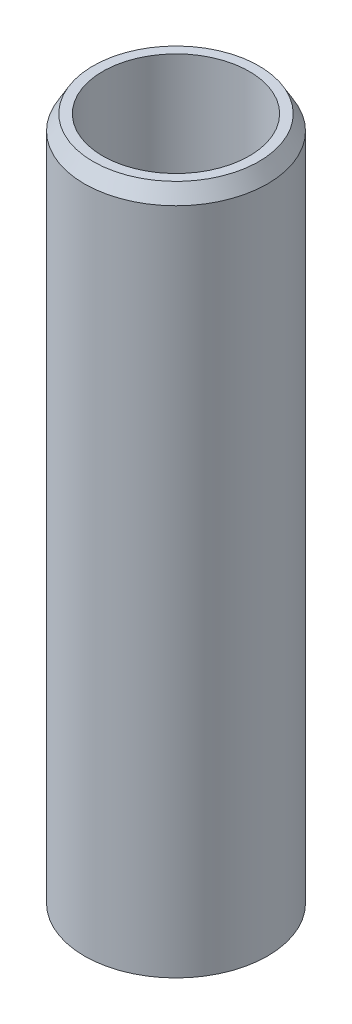
ISO-10303-21;
HEADER;
FILE_DESCRIPTION(('STEP AP214'),'2;1');
FILE_NAME('part.step','',(''),(''),'','','');
FILE_SCHEMA(('AUTOMOTIVE_DESIGN { 1 0 10303 214 1 1 1 1 }'));
ENDSEC;
DATA;
#1=APPLICATION_CONTEXT('core data for automotive mechanical design processes');
#2=APPLICATION_PROTOCOL_DEFINITION('international standard','automotive_design',2000,#1);
#3=PRODUCT_CONTEXT('',#1,'mechanical');
#4=PRODUCT('Part','Part','',(#3));
#5=PRODUCT_RELATED_PRODUCT_CATEGORY('part','',(#4));
#6=PRODUCT_DEFINITION_FORMATION('','',#4);
#7=PRODUCT_DEFINITION_CONTEXT('part definition',#1,'design');
#8=PRODUCT_DEFINITION('design','',#6,#7);
#9=PRODUCT_DEFINITION_SHAPE('','',#8);
#10=(LENGTH_UNIT() NAMED_UNIT(*) SI_UNIT(.MILLI.,.METRE.));
#11=(NAMED_UNIT(*) PLANE_ANGLE_UNIT() SI_UNIT($,.RADIAN.));
#12=(NAMED_UNIT(*) SI_UNIT($,.STERADIAN.) SOLID_ANGLE_UNIT());
#13=UNCERTAINTY_MEASURE_WITH_UNIT(LENGTH_MEASURE(1.E-05),#10,'distance_accuracy_value','');
#14=(GEOMETRIC_REPRESENTATION_CONTEXT(3) GLOBAL_UNCERTAINTY_ASSIGNED_CONTEXT((#13)) GLOBAL_UNIT_ASSIGNED_CONTEXT((#10,
#11,#12)) REPRESENTATION_CONTEXT('',''));
#15=CARTESIAN_POINT('',(0.,0.,0.));
#16=DIRECTION('',(0.,0.,1.));
#17=DIRECTION('',(1.,0.,0.));
#18=AXIS2_PLACEMENT_3D('',#15,#16,#17);
#19=CARTESIAN_POINT('',(0.,189.021684951683,0.));
#20=DIRECTION('',(0.,-1.,0.));
#21=DIRECTION('',(0.,0.,-1.));
#22=AXIS2_PLACEMENT_3D('',#19,#20,#21);
#23=CYLINDRICAL_SURFACE('',#22,25.);
#24=CARTESIAN_POINT('',(0.,184.927918246499,0.));
#25=DIRECTION('',(0.,1.,0.));
#26=DIRECTION('',(0.,0.,1.));
#27=AXIS2_PLACEMENT_3D('',#24,#25,#26);
#28=CIRCLE('',#27,25.);
#29=CARTESIAN_POINT('',(0.,184.927918246499,25.));
#30=VERTEX_POINT('',#29);
#31=EDGE_CURVE('E50',#30,#30,#28,.F.);
#32=ORIENTED_EDGE('',*,*,#31,.T.);
#33=EDGE_LOOP('',(#32));
#34=FACE_BOUND('',#33,.T.);
#35=CARTESIAN_POINT('',(0.,2.36353730923738,0.));
#36=DIRECTION('',(0.,1.,0.));
#37=DIRECTION('',(0.,0.,1.));
#38=AXIS2_PLACEMENT_3D('',#35,#36,#37);
#39=CIRCLE('',#38,25.);
#40=CARTESIAN_POINT('',(0.,2.36353730923738,25.));
#41=VERTEX_POINT('',#40);
#42=EDGE_CURVE('E51',#41,#41,#39,.T.);
#43=ORIENTED_EDGE('',*,*,#42,.T.);
#44=EDGE_LOOP('',(#43));
#45=FACE_BOUND('',#44,.T.);
#46=ADVANCED_FACE('F39',(#34,#45),#23,.T.);
#47=CARTESIAN_POINT('',(0.,189.021684951683,0.));
#48=DIRECTION('',(0.,1.,0.));
#49=DIRECTION('',(0.,0.,1.));
#50=AXIS2_PLACEMENT_3D('',#47,#48,#49);
#51=PLANE('',#50);
#52=CARTESIAN_POINT('',(0.,189.021684951683,0.));
#53=DIRECTION('',(0.,1.,0.));
#54=DIRECTION('',(0.,0.,1.));
#55=AXIS2_PLACEMENT_3D('',#52,#53,#54);
#56=CIRCLE('',#55,22.6364626907627);
#57=CARTESIAN_POINT('',(0.,189.021684951683,22.6364626907627));
#58=VERTEX_POINT('',#57);
#59=EDGE_CURVE('E54',#58,#58,#56,.T.);
#60=ORIENTED_EDGE('',*,*,#59,.T.);
#61=EDGE_LOOP('',(#60));
#62=FACE_BOUND('',#61,.T.);
#63=CARTESIAN_POINT('',(0.,189.021684951683,0.));
#64=DIRECTION('',(0.,1.,0.));
#65=DIRECTION('',(0.,0.,1.));
#66=AXIS2_PLACEMENT_3D('',#63,#64,#65);
#67=CIRCLE('',#66,20.0127329863608);
#68=CARTESIAN_POINT('',(0.,189.021684951683,20.0127329863608));
#69=VERTEX_POINT('',#68);
#70=EDGE_CURVE('E58',#69,#69,#67,.T.);
#71=ORIENTED_EDGE('',*,*,#70,.F.);
#72=EDGE_LOOP('',(#71));
#73=FACE_BOUND('',#72,.T.);
#74=ADVANCED_FACE('F69',(#62,#73),#51,.T.);
#75=CARTESIAN_POINT('',(0.,0.,0.));
#76=DIRECTION('',(0.,1.,0.));
#77=DIRECTION('',(0.,0.,1.));
#78=AXIS2_PLACEMENT_3D('',#75,#76,#77);
#79=PLANE('',#78);
#80=CARTESIAN_POINT('',(0.,0.,0.));
#81=DIRECTION('',(0.,1.,0.));
#82=DIRECTION('',(0.,0.,1.));
#83=AXIS2_PLACEMENT_3D('',#80,#81,#82);
#84=CIRCLE('',#83,20.9062332948162);
#85=CARTESIAN_POINT('',(0.,0.,20.9062332948162));
#86=VERTEX_POINT('',#85);
#87=EDGE_CURVE('E10',#86,#86,#84,.F.);
#88=ORIENTED_EDGE('',*,*,#87,.T.);
#89=EDGE_LOOP('',(#88));
#90=FACE_BOUND('',#89,.T.);
#91=CARTESIAN_POINT('',(0.,0.,0.));
#92=DIRECTION('',(0.,1.,0.));
#93=DIRECTION('',(0.,0.,1.));
#94=AXIS2_PLACEMENT_3D('',#91,#92,#93);
#95=CIRCLE('',#94,20.0127329863608);
#96=CARTESIAN_POINT('',(0.,0.,20.0127329863608));
#97=VERTEX_POINT('',#96);
#98=EDGE_CURVE('E63',#97,#97,#95,.T.);
#99=ORIENTED_EDGE('',*,*,#98,.T.);
#100=EDGE_LOOP('',(#99));
#101=FACE_BOUND('',#100,.T.);
#102=ADVANCED_FACE('F75',(#90,#101),#79,.F.);
#103=CARTESIAN_POINT('',(0.,189.021684951683,0.));
#104=DIRECTION('',(0.,-1.,0.));
#105=DIRECTION('',(0.,0.,-1.));
#106=AXIS2_PLACEMENT_3D('',#103,#104,#105);
#107=CYLINDRICAL_SURFACE('',#106,20.0127329863608);
#108=ORIENTED_EDGE('',*,*,#70,.T.);
#109=EDGE_LOOP('',(#108));
#110=FACE_BOUND('',#109,.T.);
#111=ORIENTED_EDGE('',*,*,#98,.F.);
#112=EDGE_LOOP('',(#111));
#113=FACE_BOUND('',#112,.T.);
#114=ADVANCED_FACE('F70',(#110,#113),#107,.F.);
#115=CARTESIAN_POINT('',(0.,189.021684951683,0.));
#116=DIRECTION('',(0.,-1.,0.));
#117=DIRECTION('',(0.,0.,-1.));
#118=AXIS2_PLACEMENT_3D('',#115,#116,#117);
#119=CONICAL_SURFACE('',#118,22.6364626907627,0.523598775598294);
#120=ORIENTED_EDGE('',*,*,#31,.F.);
#121=EDGE_LOOP('',(#120));
#122=FACE_BOUND('',#121,.T.);
#123=ORIENTED_EDGE('',*,*,#59,.F.);
#124=EDGE_LOOP('',(#123));
#125=FACE_BOUND('',#124,.T.);
#126=ADVANCED_FACE('F81',(#122,#125),#119,.T.);
#127=CARTESIAN_POINT('',(0.,2.36353730923738,0.));
#128=DIRECTION('',(0.,1.,0.));
#129=DIRECTION('',(0.,0.,1.));
#130=AXIS2_PLACEMENT_3D('',#127,#128,#129);
#131=CONICAL_SURFACE('',#130,25.,1.0471975511966);
#132=ORIENTED_EDGE('',*,*,#87,.F.);
#133=EDGE_LOOP('',(#132));
#134=FACE_BOUND('',#133,.T.);
#135=ORIENTED_EDGE('',*,*,#42,.F.);
#136=EDGE_LOOP('',(#135));
#137=FACE_BOUND('',#136,.T.);
#138=ADVANCED_FACE('F45',(#134,#137),#131,.T.);
#139=CLOSED_SHELL('',(#46,#74,#102,#114,#126,#138));
#140=MANIFOLD_SOLID_BREP('B2',#139);
#141=ADVANCED_BREP_SHAPE_REPRESENTATION('',(#18,#140),#14);
#142=SHAPE_DEFINITION_REPRESENTATION(#9,#141);
ENDSEC;
END-ISO-10303-21;
